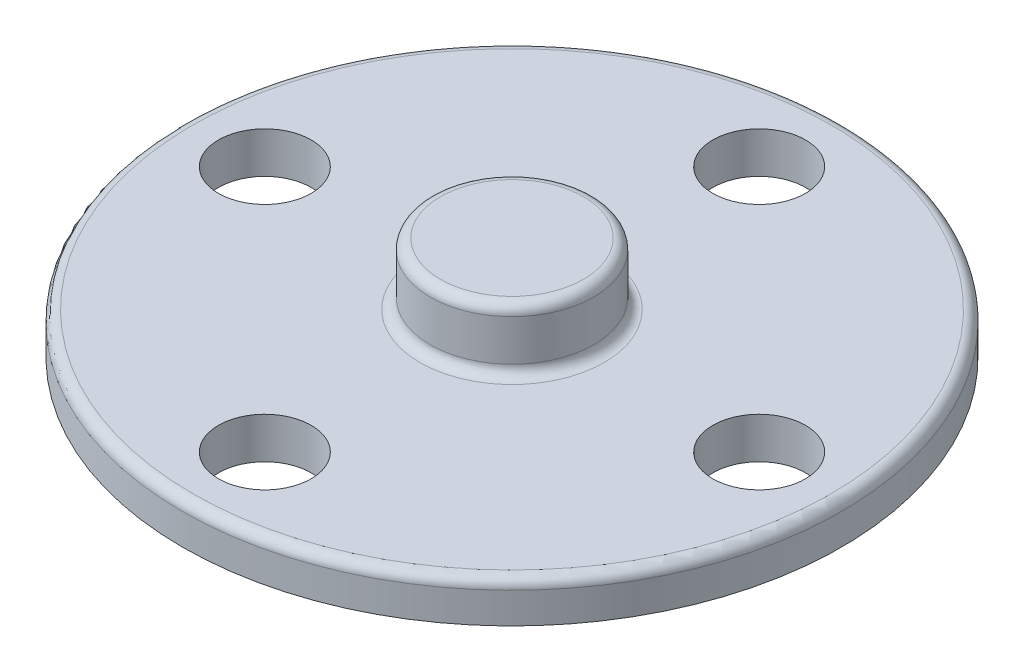
ISO-10303-21;
HEADER;
FILE_DESCRIPTION(('STEP AP214'),'2;1');
FILE_NAME('part.step','',(''),(''),'','','');
FILE_SCHEMA(('AUTOMOTIVE_DESIGN { 1 0 10303 214 1 1 1 1 }'));
ENDSEC;
DATA;
#1=APPLICATION_CONTEXT('core data for automotive mechanical design processes');
#2=APPLICATION_PROTOCOL_DEFINITION('international standard','automotive_design',2000,#1);
#3=PRODUCT_CONTEXT('',#1,'mechanical');
#4=PRODUCT('Part','Part','',(#3));
#5=PRODUCT_RELATED_PRODUCT_CATEGORY('part','',(#4));
#6=PRODUCT_DEFINITION_FORMATION('','',#4);
#7=PRODUCT_DEFINITION_CONTEXT('part definition',#1,'design');
#8=PRODUCT_DEFINITION('design','',#6,#7);
#9=PRODUCT_DEFINITION_SHAPE('','',#8);
#10=(LENGTH_UNIT() NAMED_UNIT(*) SI_UNIT(.MILLI.,.METRE.));
#11=(NAMED_UNIT(*) PLANE_ANGLE_UNIT() SI_UNIT($,.RADIAN.));
#12=(NAMED_UNIT(*) SI_UNIT($,.STERADIAN.) SOLID_ANGLE_UNIT());
#13=UNCERTAINTY_MEASURE_WITH_UNIT(LENGTH_MEASURE(1.E-05),#10,'distance_accuracy_value','');
#14=(GEOMETRIC_REPRESENTATION_CONTEXT(3) GLOBAL_UNCERTAINTY_ASSIGNED_CONTEXT((#13)) GLOBAL_UNIT_ASSIGNED_CONTEXT((#10,
#11,#12)) REPRESENTATION_CONTEXT('',''));
#15=CARTESIAN_POINT('',(0.,0.,0.));
#16=DIRECTION('',(0.,0.,1.));
#17=DIRECTION('',(1.,0.,0.));
#18=AXIS2_PLACEMENT_3D('',#15,#16,#17);
#19=CARTESIAN_POINT('',(0.,2.,0.));
#20=DIRECTION('',(0.,-1.,0.));
#21=DIRECTION('',(0.,0.,-1.));
#22=AXIS2_PLACEMENT_3D('',#19,#20,#21);
#23=CYLINDRICAL_SURFACE('',#22,16.);
#24=CARTESIAN_POINT('',(0.,1.5,0.));
#25=DIRECTION('',(0.,1.,0.));
#26=DIRECTION('',(0.,0.,1.));
#27=AXIS2_PLACEMENT_3D('',#24,#25,#26);
#28=CIRCLE('',#27,16.);
#29=CARTESIAN_POINT('',(0.,1.5,16.));
#30=VERTEX_POINT('',#29);
#31=EDGE_CURVE('E48',#30,#30,#28,.F.);
#32=ORIENTED_EDGE('',*,*,#31,.T.);
#33=EDGE_LOOP('',(#32));
#34=FACE_BOUND('',#33,.T.);
#35=CARTESIAN_POINT('',(0.,0.,0.));
#36=DIRECTION('',(0.,1.,0.));
#37=DIRECTION('',(0.,0.,1.));
#38=AXIS2_PLACEMENT_3D('',#35,#36,#37);
#39=CIRCLE('',#38,16.);
#40=CARTESIAN_POINT('',(0.,0.,16.));
#41=VERTEX_POINT('',#40);
#42=EDGE_CURVE('E59',#41,#41,#39,.T.);
#43=ORIENTED_EDGE('',*,*,#42,.T.);
#44=EDGE_LOOP('',(#43));
#45=FACE_BOUND('',#44,.T.);
#46=ADVANCED_FACE('F33',(#34,#45),#23,.T.);
#47=CARTESIAN_POINT('',(0.,2.,0.));
#48=DIRECTION('',(0.,1.,0.));
#49=DIRECTION('',(0.,0.,1.));
#50=AXIS2_PLACEMENT_3D('',#47,#48,#49);
#51=PLANE('',#50);
#52=CARTESIAN_POINT('',(0.,2.,0.));
#53=DIRECTION('',(0.,1.,0.));
#54=DIRECTION('',(0.,0.,1.));
#55=AXIS2_PLACEMENT_3D('',#52,#53,#54);
#56=CIRCLE('',#55,15.5);
#57=CARTESIAN_POINT('',(0.,2.,15.5));
#58=VERTEX_POINT('',#57);
#59=EDGE_CURVE('E53',#58,#58,#56,.T.);
#60=ORIENTED_EDGE('',*,*,#59,.T.);
#61=EDGE_LOOP('',(#60));
#62=FACE_BOUND('',#61,.T.);
#63=CARTESIAN_POINT('',(0.,2.,0.));
#64=DIRECTION('',(0.,1.,0.));
#65=DIRECTION('',(0.,0.,1.));
#66=AXIS2_PLACEMENT_3D('',#63,#64,#65);
#67=CIRCLE('',#66,4.475);
#68=CARTESIAN_POINT('',(0.,2.,4.475));
#69=VERTEX_POINT('',#68);
#70=EDGE_CURVE('E56',#69,#69,#67,.F.);
#71=ORIENTED_EDGE('',*,*,#70,.T.);
#72=EDGE_LOOP('',(#71));
#73=FACE_BOUND('',#72,.T.);
#74=CARTESIAN_POINT('',(0.,2.,-12.));
#75=DIRECTION('',(0.,1.,0.));
#76=DIRECTION('',(0.,0.,1.));
#77=AXIS2_PLACEMENT_3D('',#74,#75,#76);
#78=CIRCLE('',#77,2.25);
#79=CARTESIAN_POINT('',(0.,2.,-9.75));
#80=VERTEX_POINT('',#79);
#81=EDGE_CURVE('E81',#80,#80,#78,.T.);
#82=ORIENTED_EDGE('',*,*,#81,.F.);
#83=EDGE_LOOP('',(#82));
#84=FACE_BOUND('',#83,.T.);
#85=CARTESIAN_POINT('',(12.0000000000003,2.,-2.85117872450323E-13));
#86=DIRECTION('',(0.,1.,0.));
#87=DIRECTION('',(0.,0.,1.));
#88=AXIS2_PLACEMENT_3D('',#85,#86,#87);
#89=CIRCLE('',#88,2.25);
#90=CARTESIAN_POINT('',(12.0000000000003,2.,2.24999999999972));
#91=VERTEX_POINT('',#90);
#92=EDGE_CURVE('E75',#91,#91,#89,.T.);
#93=ORIENTED_EDGE('',*,*,#92,.F.);
#94=EDGE_LOOP('',(#93));
#95=FACE_BOUND('',#94,.T.);
#96=CARTESIAN_POINT('',(5.70235744900646E-13,2.,12.));
#97=DIRECTION('',(0.,1.,0.));
#98=DIRECTION('',(0.,0.,1.));
#99=AXIS2_PLACEMENT_3D('',#96,#97,#98);
#100=CIRCLE('',#99,2.25);
#101=CARTESIAN_POINT('',(5.70235744900646E-13,2.,14.25));
#102=VERTEX_POINT('',#101);
#103=EDGE_CURVE('E69',#102,#102,#100,.T.);
#104=ORIENTED_EDGE('',*,*,#103,.F.);
#105=EDGE_LOOP('',(#104));
#106=FACE_BOUND('',#105,.T.);
#107=CARTESIAN_POINT('',(-11.9999999999997,2.,2.865874486093E-13));
#108=DIRECTION('',(0.,1.,0.));
#109=DIRECTION('',(0.,0.,1.));
#110=AXIS2_PLACEMENT_3D('',#107,#108,#109);
#111=CIRCLE('',#110,2.25);
#112=CARTESIAN_POINT('',(-11.9999999999997,2.,2.25000000000029));
#113=VERTEX_POINT('',#112);
#114=EDGE_CURVE('E63',#113,#113,#111,.T.);
#115=ORIENTED_EDGE('',*,*,#114,.F.);
#116=EDGE_LOOP('',(#115));
#117=FACE_BOUND('',#116,.T.);
#118=ADVANCED_FACE('F98',(#62,#73,#84,#95,#106,#117),#51,.T.);
#119=CARTESIAN_POINT('',(0.,0.,0.));
#120=DIRECTION('',(0.,1.,0.));
#121=DIRECTION('',(0.,0.,1.));
#122=AXIS2_PLACEMENT_3D('',#119,#120,#121);
#123=PLANE('',#122);
#124=CARTESIAN_POINT('',(0.,0.,-12.));
#125=DIRECTION('',(0.,1.,0.));
#126=DIRECTION('',(0.,0.,1.));
#127=AXIS2_PLACEMENT_3D('',#124,#125,#126);
#128=CIRCLE('',#127,2.25);
#129=CARTESIAN_POINT('',(0.,0.,-9.75));
#130=VERTEX_POINT('',#129);
#131=EDGE_CURVE('E62',#130,#130,#128,.T.);
#132=ORIENTED_EDGE('',*,*,#131,.T.);
#133=EDGE_LOOP('',(#132));
#134=FACE_BOUND('',#133,.T.);
#135=CARTESIAN_POINT('',(12.0000000000003,0.,-2.85117872450323E-13));
#136=DIRECTION('',(0.,1.,0.));
#137=DIRECTION('',(0.,0.,1.));
#138=AXIS2_PLACEMENT_3D('',#135,#136,#137);
#139=CIRCLE('',#138,2.25);
#140=CARTESIAN_POINT('',(12.0000000000003,0.,2.24999999999972));
#141=VERTEX_POINT('',#140);
#142=EDGE_CURVE('E78',#141,#141,#139,.T.);
#143=ORIENTED_EDGE('',*,*,#142,.T.);
#144=EDGE_LOOP('',(#143));
#145=FACE_BOUND('',#144,.T.);
#146=CARTESIAN_POINT('',(5.70235744900646E-13,0.,12.));
#147=DIRECTION('',(0.,1.,0.));
#148=DIRECTION('',(0.,0.,1.));
#149=AXIS2_PLACEMENT_3D('',#146,#147,#148);
#150=CIRCLE('',#149,2.25);
#151=CARTESIAN_POINT('',(5.70235744900646E-13,0.,14.25));
#152=VERTEX_POINT('',#151);
#153=EDGE_CURVE('E72',#152,#152,#150,.T.);
#154=ORIENTED_EDGE('',*,*,#153,.T.);
#155=EDGE_LOOP('',(#154));
#156=FACE_BOUND('',#155,.T.);
#157=CARTESIAN_POINT('',(-11.9999999999997,0.,2.865874486093E-13));
#158=DIRECTION('',(0.,1.,0.));
#159=DIRECTION('',(0.,0.,1.));
#160=AXIS2_PLACEMENT_3D('',#157,#158,#159);
#161=CIRCLE('',#160,2.25);
#162=CARTESIAN_POINT('',(-11.9999999999997,0.,2.25000000000029));
#163=VERTEX_POINT('',#162);
#164=EDGE_CURVE('E66',#163,#163,#161,.T.);
#165=ORIENTED_EDGE('',*,*,#164,.T.);
#166=EDGE_LOOP('',(#165));
#167=FACE_BOUND('',#166,.T.);
#168=ORIENTED_EDGE('',*,*,#42,.F.);
#169=EDGE_LOOP('',(#168));
#170=FACE_BOUND('',#169,.T.);
#171=ADVANCED_FACE('F87',(#134,#145,#156,#167,#170),#123,.F.);
#172=CARTESIAN_POINT('',(-11.9999999999997,0.,2.865874486093E-13));
#173=DIRECTION('',(0.,1.,0.));
#174=DIRECTION('',(0.,0.,1.));
#175=AXIS2_PLACEMENT_3D('',#172,#173,#174);
#176=CYLINDRICAL_SURFACE('',#175,2.25);
#177=ORIENTED_EDGE('',*,*,#164,.F.);
#178=EDGE_LOOP('',(#177));
#179=FACE_BOUND('',#178,.T.);
#180=ORIENTED_EDGE('',*,*,#114,.T.);
#181=EDGE_LOOP('',(#180));
#182=FACE_BOUND('',#181,.T.);
#183=ADVANCED_FACE('F109',(#179,#182),#176,.F.);
#184=CARTESIAN_POINT('',(5.70235744900646E-13,0.,12.));
#185=DIRECTION('',(0.,1.,0.));
#186=DIRECTION('',(0.,0.,1.));
#187=AXIS2_PLACEMENT_3D('',#184,#185,#186);
#188=CYLINDRICAL_SURFACE('',#187,2.25);
#189=ORIENTED_EDGE('',*,*,#153,.F.);
#190=EDGE_LOOP('',(#189));
#191=FACE_BOUND('',#190,.T.);
#192=ORIENTED_EDGE('',*,*,#103,.T.);
#193=EDGE_LOOP('',(#192));
#194=FACE_BOUND('',#193,.T.);
#195=ADVANCED_FACE('F111',(#191,#194),#188,.F.);
#196=CARTESIAN_POINT('',(12.0000000000003,0.,-2.85117872450323E-13));
#197=DIRECTION('',(0.,1.,0.));
#198=DIRECTION('',(0.,0.,1.));
#199=AXIS2_PLACEMENT_3D('',#196,#197,#198);
#200=CYLINDRICAL_SURFACE('',#199,2.25);
#201=ORIENTED_EDGE('',*,*,#142,.F.);
#202=EDGE_LOOP('',(#201));
#203=FACE_BOUND('',#202,.T.);
#204=ORIENTED_EDGE('',*,*,#92,.T.);
#205=EDGE_LOOP('',(#204));
#206=FACE_BOUND('',#205,.T.);
#207=ADVANCED_FACE('F94',(#203,#206),#200,.F.);
#208=CARTESIAN_POINT('',(0.,0.,-12.));
#209=DIRECTION('',(0.,1.,0.));
#210=DIRECTION('',(0.,0.,1.));
#211=AXIS2_PLACEMENT_3D('',#208,#209,#210);
#212=CYLINDRICAL_SURFACE('',#211,2.25);
#213=ORIENTED_EDGE('',*,*,#131,.F.);
#214=EDGE_LOOP('',(#213));
#215=FACE_BOUND('',#214,.T.);
#216=ORIENTED_EDGE('',*,*,#81,.T.);
#217=EDGE_LOOP('',(#216));
#218=FACE_BOUND('',#217,.T.);
#219=ADVANCED_FACE('F90',(#215,#218),#212,.F.);
#220=CARTESIAN_POINT('',(0.,5.,0.));
#221=DIRECTION('',(0.,-1.,0.));
#222=DIRECTION('',(0.,0.,-1.));
#223=AXIS2_PLACEMENT_3D('',#220,#221,#222);
#224=CYLINDRICAL_SURFACE('',#223,3.975);
#225=CARTESIAN_POINT('',(0.,4.5,0.));
#226=DIRECTION('',(0.,1.,0.));
#227=DIRECTION('',(0.,0.,1.));
#228=AXIS2_PLACEMENT_3D('',#225,#226,#227);
#229=CIRCLE('',#228,3.975);
#230=CARTESIAN_POINT('',(0.,4.5,3.975));
#231=VERTEX_POINT('',#230);
#232=EDGE_CURVE('E10',#231,#231,#229,.F.);
#233=ORIENTED_EDGE('',*,*,#232,.T.);
#234=EDGE_LOOP('',(#233));
#235=FACE_BOUND('',#234,.T.);
#236=CARTESIAN_POINT('',(0.,2.5,0.));
#237=DIRECTION('',(0.,1.,0.));
#238=DIRECTION('',(0.,0.,1.));
#239=AXIS2_PLACEMENT_3D('',#236,#237,#238);
#240=CIRCLE('',#239,3.975);
#241=CARTESIAN_POINT('',(0.,2.5,3.975));
#242=VERTEX_POINT('',#241);
#243=EDGE_CURVE('E40',#242,#242,#240,.T.);
#244=ORIENTED_EDGE('',*,*,#243,.T.);
#245=EDGE_LOOP('',(#244));
#246=FACE_BOUND('',#245,.T.);
#247=ADVANCED_FACE('F93',(#235,#246),#224,.T.);
#248=CARTESIAN_POINT('',(0.,5.,0.));
#249=DIRECTION('',(0.,1.,0.));
#250=DIRECTION('',(0.,0.,1.));
#251=AXIS2_PLACEMENT_3D('',#248,#249,#250);
#252=PLANE('',#251);
#253=CARTESIAN_POINT('',(0.,5.,0.));
#254=DIRECTION('',(0.,1.,0.));
#255=DIRECTION('',(0.,0.,1.));
#256=AXIS2_PLACEMENT_3D('',#253,#254,#255);
#257=CIRCLE('',#256,3.475);
#258=CARTESIAN_POINT('',(0.,5.,3.475));
#259=VERTEX_POINT('',#258);
#260=EDGE_CURVE('E44',#259,#259,#257,.T.);
#261=ORIENTED_EDGE('',*,*,#260,.T.);
#262=EDGE_LOOP('',(#261));
#263=FACE_BOUND('',#262,.T.);
#264=ADVANCED_FACE('F132',(#263),#252,.T.);
#265=CARTESIAN_POINT('',(0.,1.5,0.));
#266=DIRECTION('',(0.,1.,0.));
#267=DIRECTION('',(0.,0.,1.));
#268=AXIS2_PLACEMENT_3D('',#265,#266,#267);
#269=TOROIDAL_SURFACE('',#268,15.5,0.5);
#270=ORIENTED_EDGE('',*,*,#31,.F.);
#271=EDGE_LOOP('',(#270));
#272=FACE_BOUND('',#271,.T.);
#273=ORIENTED_EDGE('',*,*,#59,.F.);
#274=EDGE_LOOP('',(#273));
#275=FACE_BOUND('',#274,.T.);
#276=ADVANCED_FACE('F129',(#272,#275),#269,.T.);
#277=CARTESIAN_POINT('',(0.,4.5,0.));
#278=DIRECTION('',(0.,1.,0.));
#279=DIRECTION('',(0.,0.,1.));
#280=AXIS2_PLACEMENT_3D('',#277,#278,#279);
#281=TOROIDAL_SURFACE('',#280,3.475,0.5);
#282=ORIENTED_EDGE('',*,*,#232,.F.);
#283=EDGE_LOOP('',(#282));
#284=FACE_BOUND('',#283,.T.);
#285=ORIENTED_EDGE('',*,*,#260,.F.);
#286=EDGE_LOOP('',(#285));
#287=FACE_BOUND('',#286,.T.);
#288=ADVANCED_FACE('F131',(#284,#287),#281,.T.);
#289=CARTESIAN_POINT('',(0.,2.5,0.));
#290=DIRECTION('',(0.,1.,0.));
#291=DIRECTION('',(0.,0.,1.));
#292=AXIS2_PLACEMENT_3D('',#289,#290,#291);
#293=TOROIDAL_SURFACE('',#292,4.475,0.5);
#294=ORIENTED_EDGE('',*,*,#70,.F.);
#295=EDGE_LOOP('',(#294));
#296=FACE_BOUND('',#295,.T.);
#297=ORIENTED_EDGE('',*,*,#243,.F.);
#298=EDGE_LOOP('',(#297));
#299=FACE_BOUND('',#298,.T.);
#300=ADVANCED_FACE('F35',(#296,#299),#293,.F.);
#301=CLOSED_SHELL('',(#46,#118,#171,#183,#195,#207,#219,#247,#264,#276,#288,#300));
#302=MANIFOLD_SOLID_BREP('B2',#301);
#303=ADVANCED_BREP_SHAPE_REPRESENTATION('',(#18,#302),#14);
#304=SHAPE_DEFINITION_REPRESENTATION(#9,#303);
ENDSEC;
END-ISO-10303-21;
